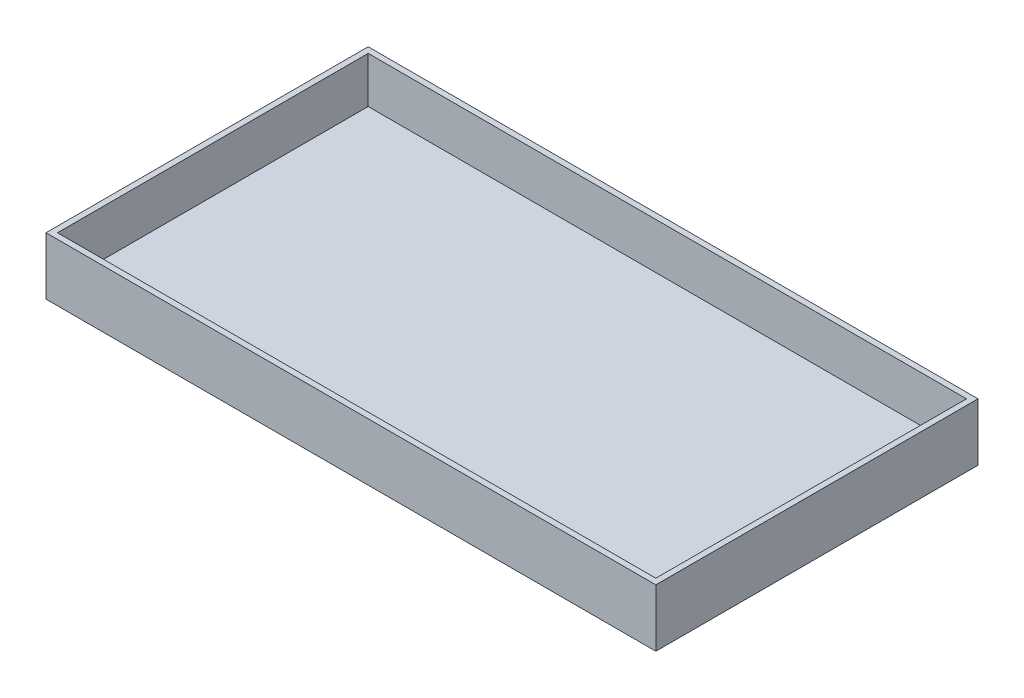
ISO-10303-21;
HEADER;
FILE_DESCRIPTION(('STEP AP214'),'2;1');
FILE_NAME('part.step','',(''),(''),'','','');
FILE_SCHEMA(('AUTOMOTIVE_DESIGN { 1 0 10303 214 1 1 1 1 }'));
ENDSEC;
DATA;
#1=APPLICATION_CONTEXT('core data for automotive mechanical design processes');
#2=APPLICATION_PROTOCOL_DEFINITION('international standard','automotive_design',2000,#1);
#3=PRODUCT_CONTEXT('',#1,'mechanical');
#4=PRODUCT('Part','Part','',(#3));
#5=PRODUCT_RELATED_PRODUCT_CATEGORY('part','',(#4));
#6=PRODUCT_DEFINITION_FORMATION('','',#4);
#7=PRODUCT_DEFINITION_CONTEXT('part definition',#1,'design');
#8=PRODUCT_DEFINITION('design','',#6,#7);
#9=PRODUCT_DEFINITION_SHAPE('','',#8);
#10=(LENGTH_UNIT() NAMED_UNIT(*) SI_UNIT(.MILLI.,.METRE.));
#11=(NAMED_UNIT(*) PLANE_ANGLE_UNIT() SI_UNIT($,.RADIAN.));
#12=(NAMED_UNIT(*) SI_UNIT($,.STERADIAN.) SOLID_ANGLE_UNIT());
#13=UNCERTAINTY_MEASURE_WITH_UNIT(LENGTH_MEASURE(1.E-05),#10,'distance_accuracy_value','');
#14=(GEOMETRIC_REPRESENTATION_CONTEXT(3) GLOBAL_UNCERTAINTY_ASSIGNED_CONTEXT((#13)) GLOBAL_UNIT_ASSIGNED_CONTEXT((#10,
#11,#12)) REPRESENTATION_CONTEXT('',''));
#15=CARTESIAN_POINT('',(0.,0.,0.));
#16=DIRECTION('',(0.,0.,1.));
#17=DIRECTION('',(1.,0.,0.));
#18=AXIS2_PLACEMENT_3D('',#15,#16,#17);
#19=CARTESIAN_POINT('',(52.,10.,-27.));
#20=DIRECTION('',(-1.,0.,0.));
#21=DIRECTION('',(0.,0.,1.));
#22=AXIS2_PLACEMENT_3D('',#19,#20,#21);
#23=PLANE('',#22);
#24=DIRECTION('',(0.,-1.,0.));
#25=VECTOR('',#24,1.);
#26=CARTESIAN_POINT('',(52.,10.,-27.));
#27=LINE('',#26,#25);
#28=CARTESIAN_POINT('',(52.,10.,-27.));
#29=VERTEX_POINT('',#28);
#30=CARTESIAN_POINT('',(52.,2.,-27.));
#31=VERTEX_POINT('',#30);
#32=EDGE_CURVE('E105',#29,#31,#27,.T.);
#33=ORIENTED_EDGE('',*,*,#32,.T.);
#34=DIRECTION('',(0.,0.,1.));
#35=VECTOR('',#34,1.);
#36=CARTESIAN_POINT('',(52.,2.,-27.));
#37=LINE('',#36,#35);
#38=CARTESIAN_POINT('',(52.,2.,27.));
#39=VERTEX_POINT('',#38);
#40=EDGE_CURVE('E96',#31,#39,#37,.T.);
#41=ORIENTED_EDGE('',*,*,#40,.T.);
#42=DIRECTION('',(0.,-1.,0.));
#43=VECTOR('',#42,1.);
#44=CARTESIAN_POINT('',(52.,10.,27.));
#45=LINE('',#44,#43);
#46=CARTESIAN_POINT('',(52.,10.,27.));
#47=VERTEX_POINT('',#46);
#48=EDGE_CURVE('E102',#47,#39,#45,.T.);
#49=ORIENTED_EDGE('',*,*,#48,.F.);
#50=DIRECTION('',(0.,0.,-1.));
#51=VECTOR('',#50,1.);
#52=CARTESIAN_POINT('',(52.,10.,-27.));
#53=LINE('',#52,#51);
#54=EDGE_CURVE('E106',#47,#29,#53,.T.);
#55=ORIENTED_EDGE('',*,*,#54,.T.);
#56=EDGE_LOOP('',(#33,#41,#49,#55));
#57=FACE_BOUND('',#56,.T.);
#58=ADVANCED_FACE('F33',(#57),#23,.T.);
#59=CARTESIAN_POINT('',(-52.,10.,-27.));
#60=DIRECTION('',(0.,0.,1.));
#61=DIRECTION('',(1.,0.,0.));
#62=AXIS2_PLACEMENT_3D('',#59,#60,#61);
#63=PLANE('',#62);
#64=DIRECTION('',(0.,-1.,0.));
#65=VECTOR('',#64,1.);
#66=CARTESIAN_POINT('',(-52.,10.,-27.));
#67=LINE('',#66,#65);
#68=CARTESIAN_POINT('',(-52.,10.,-27.));
#69=VERTEX_POINT('',#68);
#70=CARTESIAN_POINT('',(-52.,2.,-27.));
#71=VERTEX_POINT('',#70);
#72=EDGE_CURVE('E113',#69,#71,#67,.T.);
#73=ORIENTED_EDGE('',*,*,#72,.T.);
#74=DIRECTION('',(1.,0.,0.));
#75=VECTOR('',#74,1.);
#76=CARTESIAN_POINT('',(-52.,2.,-27.));
#77=LINE('',#76,#75);
#78=EDGE_CURVE('E107',#71,#31,#77,.T.);
#79=ORIENTED_EDGE('',*,*,#78,.T.);
#80=ORIENTED_EDGE('',*,*,#32,.F.);
#81=DIRECTION('',(-1.,0.,0.));
#82=VECTOR('',#81,1.);
#83=CARTESIAN_POINT('',(-52.,10.,-27.));
#84=LINE('',#83,#82);
#85=EDGE_CURVE('E175',#29,#69,#84,.T.);
#86=ORIENTED_EDGE('',*,*,#85,.T.);
#87=EDGE_LOOP('',(#73,#79,#80,#86));
#88=FACE_BOUND('',#87,.T.);
#89=ADVANCED_FACE('F184',(#88),#63,.T.);
#90=CARTESIAN_POINT('',(-52.,10.,-27.));
#91=DIRECTION('',(1.,0.,0.));
#92=DIRECTION('',(0.,0.,-1.));
#93=AXIS2_PLACEMENT_3D('',#90,#91,#92);
#94=PLANE('',#93);
#95=DIRECTION('',(0.,-1.,0.));
#96=VECTOR('',#95,1.);
#97=CARTESIAN_POINT('',(-52.,10.,27.));
#98=LINE('',#97,#96);
#99=CARTESIAN_POINT('',(-52.,10.,27.));
#100=VERTEX_POINT('',#99);
#101=CARTESIAN_POINT('',(-52.,2.,27.));
#102=VERTEX_POINT('',#101);
#103=EDGE_CURVE('E54',#100,#102,#98,.T.);
#104=ORIENTED_EDGE('',*,*,#103,.T.);
#105=DIRECTION('',(0.,0.,-1.));
#106=VECTOR('',#105,1.);
#107=CARTESIAN_POINT('',(-52.,2.,-27.));
#108=LINE('',#107,#106);
#109=EDGE_CURVE('E48',#102,#71,#108,.T.);
#110=ORIENTED_EDGE('',*,*,#109,.T.);
#111=ORIENTED_EDGE('',*,*,#72,.F.);
#112=DIRECTION('',(0.,0.,1.));
#113=VECTOR('',#112,1.);
#114=CARTESIAN_POINT('',(-52.,10.,-27.));
#115=LINE('',#114,#113);
#116=EDGE_CURVE('E115',#69,#100,#115,.T.);
#117=ORIENTED_EDGE('',*,*,#116,.T.);
#118=EDGE_LOOP('',(#104,#110,#111,#117));
#119=FACE_BOUND('',#118,.T.);
#120=ADVANCED_FACE('F183',(#119),#94,.T.);
#121=CARTESIAN_POINT('',(-52.,10.,27.));
#122=DIRECTION('',(0.,0.,-1.));
#123=DIRECTION('',(-1.,0.,0.));
#124=AXIS2_PLACEMENT_3D('',#121,#122,#123);
#125=PLANE('',#124);
#126=ORIENTED_EDGE('',*,*,#48,.T.);
#127=DIRECTION('',(-1.,0.,0.));
#128=VECTOR('',#127,1.);
#129=CARTESIAN_POINT('',(-52.,2.,27.));
#130=LINE('',#129,#128);
#131=EDGE_CURVE('E11',#39,#102,#130,.T.);
#132=ORIENTED_EDGE('',*,*,#131,.T.);
#133=ORIENTED_EDGE('',*,*,#103,.F.);
#134=DIRECTION('',(1.,0.,0.));
#135=VECTOR('',#134,1.);
#136=CARTESIAN_POINT('',(-52.,10.,27.));
#137=LINE('',#136,#135);
#138=EDGE_CURVE('E111',#100,#47,#137,.T.);
#139=ORIENTED_EDGE('',*,*,#138,.T.);
#140=EDGE_LOOP('',(#126,#132,#133,#139));
#141=FACE_BOUND('',#140,.T.);
#142=ADVANCED_FACE('F109',(#141),#125,.T.);
#143=CARTESIAN_POINT('',(0.,10.,0.));
#144=DIRECTION('',(0.,1.,0.));
#145=DIRECTION('',(0.,0.,1.));
#146=AXIS2_PLACEMENT_3D('',#143,#144,#145);
#147=PLANE('',#146);
#148=DIRECTION('',(0.,0.,-1.));
#149=VECTOR('',#148,1.);
#150=CARTESIAN_POINT('',(53.,10.,-28.));
#151=LINE('',#150,#149);
#152=CARTESIAN_POINT('',(53.,10.,28.));
#153=VERTEX_POINT('',#152);
#154=CARTESIAN_POINT('',(53.,10.,-28.));
#155=VERTEX_POINT('',#154);
#156=EDGE_CURVE('E123',#153,#155,#151,.T.);
#157=ORIENTED_EDGE('',*,*,#156,.T.);
#158=DIRECTION('',(-1.,0.,0.));
#159=VECTOR('',#158,1.);
#160=CARTESIAN_POINT('',(-53.,10.,-28.));
#161=LINE('',#160,#159);
#162=CARTESIAN_POINT('',(-53.,10.,-28.));
#163=VERTEX_POINT('',#162);
#164=EDGE_CURVE('E126',#155,#163,#161,.T.);
#165=ORIENTED_EDGE('',*,*,#164,.T.);
#166=DIRECTION('',(0.,0.,1.));
#167=VECTOR('',#166,1.);
#168=CARTESIAN_POINT('',(-53.,10.,-28.));
#169=LINE('',#168,#167);
#170=CARTESIAN_POINT('',(-53.,10.,28.));
#171=VERTEX_POINT('',#170);
#172=EDGE_CURVE('E129',#163,#171,#169,.T.);
#173=ORIENTED_EDGE('',*,*,#172,.T.);
#174=DIRECTION('',(1.,0.,0.));
#175=VECTOR('',#174,1.);
#176=CARTESIAN_POINT('',(-53.,10.,28.));
#177=LINE('',#176,#175);
#178=EDGE_CURVE('E131',#171,#153,#177,.T.);
#179=ORIENTED_EDGE('',*,*,#178,.T.);
#180=EDGE_LOOP('',(#157,#165,#173,#179));
#181=FACE_BOUND('',#180,.T.);
#182=ORIENTED_EDGE('',*,*,#85,.F.);
#183=ORIENTED_EDGE('',*,*,#54,.F.);
#184=ORIENTED_EDGE('',*,*,#138,.F.);
#185=ORIENTED_EDGE('',*,*,#116,.F.);
#186=EDGE_LOOP('',(#182,#183,#184,#185));
#187=FACE_BOUND('',#186,.T.);
#188=ADVANCED_FACE('F169',(#181,#187),#147,.T.);
#189=CARTESIAN_POINT('',(0.,0.,0.));
#190=DIRECTION('',(0.,1.,0.));
#191=DIRECTION('',(0.,0.,1.));
#192=AXIS2_PLACEMENT_3D('',#189,#190,#191);
#193=PLANE('',#192);
#194=DIRECTION('',(0.,0.,-1.));
#195=VECTOR('',#194,1.);
#196=CARTESIAN_POINT('',(53.,0.,-28.));
#197=LINE('',#196,#195);
#198=CARTESIAN_POINT('',(53.,0.,28.));
#199=VERTEX_POINT('',#198);
#200=CARTESIAN_POINT('',(53.,0.,-28.));
#201=VERTEX_POINT('',#200);
#202=EDGE_CURVE('E122',#199,#201,#197,.T.);
#203=ORIENTED_EDGE('',*,*,#202,.F.);
#204=DIRECTION('',(1.,0.,0.));
#205=VECTOR('',#204,1.);
#206=CARTESIAN_POINT('',(-53.,0.,28.));
#207=LINE('',#206,#205);
#208=CARTESIAN_POINT('',(-53.,0.,28.));
#209=VERTEX_POINT('',#208);
#210=EDGE_CURVE('E127',#209,#199,#207,.T.);
#211=ORIENTED_EDGE('',*,*,#210,.F.);
#212=DIRECTION('',(0.,0.,1.));
#213=VECTOR('',#212,1.);
#214=CARTESIAN_POINT('',(-53.,0.,-28.));
#215=LINE('',#214,#213);
#216=CARTESIAN_POINT('',(-53.,0.,-28.));
#217=VERTEX_POINT('',#216);
#218=EDGE_CURVE('E139',#217,#209,#215,.T.);
#219=ORIENTED_EDGE('',*,*,#218,.F.);
#220=DIRECTION('',(-1.,0.,0.));
#221=VECTOR('',#220,1.);
#222=CARTESIAN_POINT('',(-53.,0.,-28.));
#223=LINE('',#222,#221);
#224=EDGE_CURVE('E136',#201,#217,#223,.T.);
#225=ORIENTED_EDGE('',*,*,#224,.F.);
#226=EDGE_LOOP('',(#203,#211,#219,#225));
#227=FACE_BOUND('',#226,.T.);
#228=ADVANCED_FACE('F158',(#227),#193,.F.);
#229=CARTESIAN_POINT('',(53.,10.,-28.));
#230=DIRECTION('',(-1.,0.,0.));
#231=DIRECTION('',(0.,0.,1.));
#232=AXIS2_PLACEMENT_3D('',#229,#230,#231);
#233=PLANE('',#232);
#234=ORIENTED_EDGE('',*,*,#202,.T.);
#235=DIRECTION('',(0.,-1.,0.));
#236=VECTOR('',#235,1.);
#237=CARTESIAN_POINT('',(53.,10.,-28.));
#238=LINE('',#237,#236);
#239=EDGE_CURVE('E41',#155,#201,#238,.T.);
#240=ORIENTED_EDGE('',*,*,#239,.F.);
#241=ORIENTED_EDGE('',*,*,#156,.F.);
#242=DIRECTION('',(0.,-1.,0.));
#243=VECTOR('',#242,1.);
#244=CARTESIAN_POINT('',(53.,10.,28.));
#245=LINE('',#244,#243);
#246=EDGE_CURVE('E133',#153,#199,#245,.T.);
#247=ORIENTED_EDGE('',*,*,#246,.T.);
#248=EDGE_LOOP('',(#234,#240,#241,#247));
#249=FACE_BOUND('',#248,.T.);
#250=ADVANCED_FACE('F35',(#249),#233,.F.);
#251=CARTESIAN_POINT('',(-53.,10.,-28.));
#252=DIRECTION('',(0.,0.,1.));
#253=DIRECTION('',(1.,0.,0.));
#254=AXIS2_PLACEMENT_3D('',#251,#252,#253);
#255=PLANE('',#254);
#256=ORIENTED_EDGE('',*,*,#224,.T.);
#257=DIRECTION('',(0.,-1.,0.));
#258=VECTOR('',#257,1.);
#259=CARTESIAN_POINT('',(-53.,10.,-28.));
#260=LINE('',#259,#258);
#261=EDGE_CURVE('E147',#163,#217,#260,.T.);
#262=ORIENTED_EDGE('',*,*,#261,.F.);
#263=ORIENTED_EDGE('',*,*,#164,.F.);
#264=ORIENTED_EDGE('',*,*,#239,.T.);
#265=EDGE_LOOP('',(#256,#262,#263,#264));
#266=FACE_BOUND('',#265,.T.);
#267=ADVANCED_FACE('F151',(#266),#255,.F.);
#268=CARTESIAN_POINT('',(-53.,10.,-28.));
#269=DIRECTION('',(1.,0.,0.));
#270=DIRECTION('',(0.,0.,-1.));
#271=AXIS2_PLACEMENT_3D('',#268,#269,#270);
#272=PLANE('',#271);
#273=ORIENTED_EDGE('',*,*,#218,.T.);
#274=DIRECTION('',(0.,-1.,0.));
#275=VECTOR('',#274,1.);
#276=CARTESIAN_POINT('',(-53.,10.,28.));
#277=LINE('',#276,#275);
#278=EDGE_CURVE('E145',#171,#209,#277,.T.);
#279=ORIENTED_EDGE('',*,*,#278,.F.);
#280=ORIENTED_EDGE('',*,*,#172,.F.);
#281=ORIENTED_EDGE('',*,*,#261,.T.);
#282=EDGE_LOOP('',(#273,#279,#280,#281));
#283=FACE_BOUND('',#282,.T.);
#284=ADVANCED_FACE('F167',(#283),#272,.F.);
#285=CARTESIAN_POINT('',(-53.,10.,28.));
#286=DIRECTION('',(0.,0.,-1.));
#287=DIRECTION('',(-1.,0.,0.));
#288=AXIS2_PLACEMENT_3D('',#285,#286,#287);
#289=PLANE('',#288);
#290=ORIENTED_EDGE('',*,*,#210,.T.);
#291=ORIENTED_EDGE('',*,*,#246,.F.);
#292=ORIENTED_EDGE('',*,*,#178,.F.);
#293=ORIENTED_EDGE('',*,*,#278,.T.);
#294=EDGE_LOOP('',(#290,#291,#292,#293));
#295=FACE_BOUND('',#294,.T.);
#296=ADVANCED_FACE('F163',(#295),#289,.F.);
#297=CARTESIAN_POINT('',(0.,2.,0.));
#298=DIRECTION('',(0.,-1.,0.));
#299=DIRECTION('',(0.,0.,-1.));
#300=AXIS2_PLACEMENT_3D('',#297,#298,#299);
#301=PLANE('',#300);
#302=ORIENTED_EDGE('',*,*,#40,.F.);
#303=ORIENTED_EDGE('',*,*,#78,.F.);
#304=ORIENTED_EDGE('',*,*,#109,.F.);
#305=ORIENTED_EDGE('',*,*,#131,.F.);
#306=EDGE_LOOP('',(#302,#303,#304,#305));
#307=FACE_BOUND('',#306,.T.);
#308=ADVANCED_FACE('F95',(#307),#301,.F.);
#309=CLOSED_SHELL('',(#58,#89,#120,#142,#188,#228,#250,#267,#284,#296,#308));
#310=MANIFOLD_SOLID_BREP('B2',#309);
#311=ADVANCED_BREP_SHAPE_REPRESENTATION('',(#18,#310),#14);
#312=SHAPE_DEFINITION_REPRESENTATION(#9,#311);
ENDSEC;
END-ISO-10303-21;
